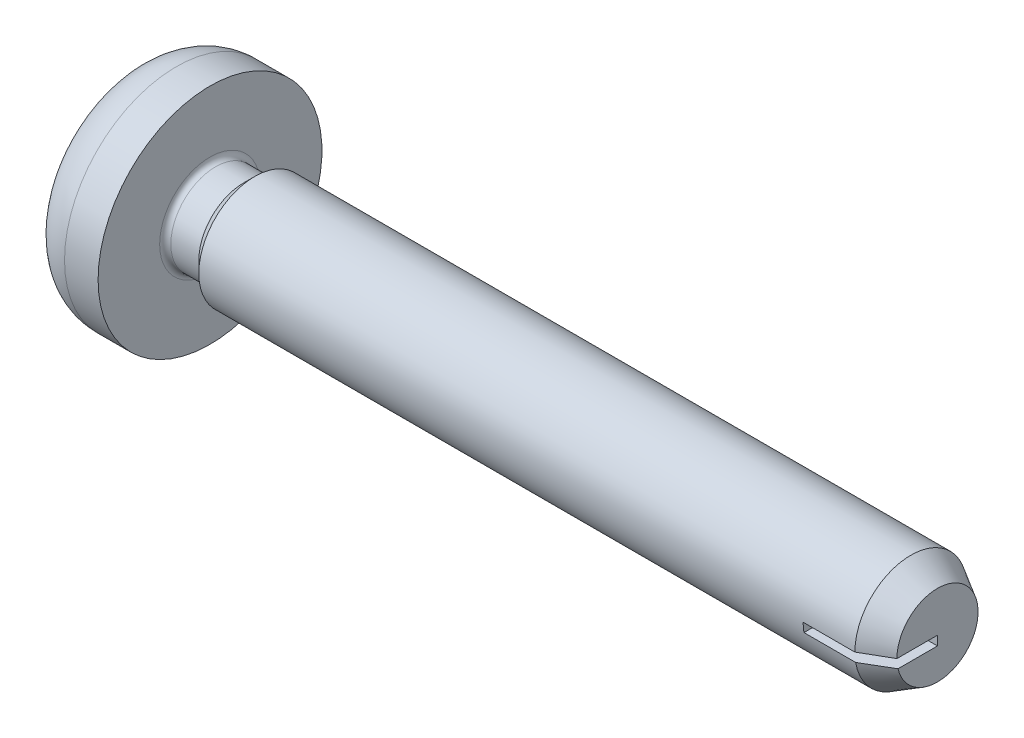
ISO-10303-21;
HEADER;
FILE_DESCRIPTION(('STEP AP214'),'2;1');
FILE_NAME('part.step','',(''),(''),'','','');
FILE_SCHEMA(('AUTOMOTIVE_DESIGN { 1 0 10303 214 1 1 1 1 }'));
ENDSEC;
DATA;
#1=APPLICATION_CONTEXT('core data for automotive mechanical design processes');
#2=APPLICATION_PROTOCOL_DEFINITION('international standard','automotive_design',2000,#1);
#3=PRODUCT_CONTEXT('',#1,'mechanical');
#4=PRODUCT('Part','Part','',(#3));
#5=PRODUCT_RELATED_PRODUCT_CATEGORY('part','',(#4));
#6=PRODUCT_DEFINITION_FORMATION('','',#4);
#7=PRODUCT_DEFINITION_CONTEXT('part definition',#1,'design');
#8=PRODUCT_DEFINITION('design','',#6,#7);
#9=PRODUCT_DEFINITION_SHAPE('','',#8);
#10=(LENGTH_UNIT() NAMED_UNIT(*) SI_UNIT(.MILLI.,.METRE.));
#11=(NAMED_UNIT(*) PLANE_ANGLE_UNIT() SI_UNIT($,.RADIAN.));
#12=(NAMED_UNIT(*) SI_UNIT($,.STERADIAN.) SOLID_ANGLE_UNIT());
#13=UNCERTAINTY_MEASURE_WITH_UNIT(LENGTH_MEASURE(1.E-05),#10,'distance_accuracy_value','');
#14=(GEOMETRIC_REPRESENTATION_CONTEXT(3) GLOBAL_UNCERTAINTY_ASSIGNED_CONTEXT((#13)) GLOBAL_UNIT_ASSIGNED_CONTEXT((#10,
#11,#12)) REPRESENTATION_CONTEXT('',''));
#15=CARTESIAN_POINT('',(0.,0.,0.));
#16=DIRECTION('',(0.,0.,1.));
#17=DIRECTION('',(1.,0.,0.));
#18=AXIS2_PLACEMENT_3D('',#15,#16,#17);
#19=CARTESIAN_POINT('',(0.,0.,0.));
#20=DIRECTION('',(-1.,0.,0.));
#21=DIRECTION('',(0.,0.,1.));
#22=AXIS2_PLACEMENT_3D('',#19,#20,#21);
#23=CYLINDRICAL_SURFACE('',#22,1.);
#24=CARTESIAN_POINT('',(2.2,0.,0.));
#25=DIRECTION('',(-1.,0.,0.));
#26=DIRECTION('',(0.,0.,1.));
#27=AXIS2_PLACEMENT_3D('',#24,#25,#26);
#28=CIRCLE('',#27,1.);
#29=CARTESIAN_POINT('',(2.2,0.,0.999999999999998));
#30=VERTEX_POINT('',#29);
#31=EDGE_CURVE('E188',#30,#30,#28,.T.);
#32=ORIENTED_EDGE('',*,*,#31,.F.);
#33=EDGE_LOOP('',(#32));
#34=FACE_BOUND('',#33,.T.);
#35=DIRECTION('',(-1.,0.,0.));
#36=VECTOR('',#35,1.);
#37=CARTESIAN_POINT('',(0.,0.,1.));
#38=LINE('',#37,#36);
#39=CARTESIAN_POINT('',(13.9236860279185,0.,1.));
#40=VERTEX_POINT('',#39);
#41=CARTESIAN_POINT('',(13.,0.,0.999999999999999));
#42=VERTEX_POINT('',#41);
#43=EDGE_CURVE('E387',#40,#42,#38,.T.);
#44=ORIENTED_EDGE('',*,*,#43,.F.);
#45=CARTESIAN_POINT('',(13.9236860279185,0.,0.));
#46=DIRECTION('',(-1.,0.,0.));
#47=DIRECTION('',(0.,0.,1.));
#48=AXIS2_PLACEMENT_3D('',#45,#46,#47);
#49=CIRCLE('',#48,1.);
#50=CARTESIAN_POINT('',(13.9236860279185,-0.166666666666662,0.986013297183272));
#51=VERTEX_POINT('',#50);
#52=EDGE_CURVE('E383',#40,#51,#49,.T.);
#53=ORIENTED_EDGE('',*,*,#52,.T.);
#54=DIRECTION('',(-1.,0.,0.));
#55=VECTOR('',#54,1.);
#56=CARTESIAN_POINT('',(0.,-0.166666666666669,0.986013297183258));
#57=LINE('',#56,#55);
#58=CARTESIAN_POINT('',(13.,-0.166666666666662,0.98601329718327));
#59=VERTEX_POINT('',#58);
#60=EDGE_CURVE('E393',#59,#51,#57,.F.);
#61=ORIENTED_EDGE('',*,*,#60,.F.);
#62=CARTESIAN_POINT('',(13.,0.,0.));
#63=DIRECTION('',(1.,0.,0.));
#64=DIRECTION('',(0.,0.,-1.));
#65=AXIS2_PLACEMENT_3D('',#62,#63,#64);
#66=CIRCLE('',#65,1.);
#67=EDGE_CURVE('E11',#42,#59,#66,.T.);
#68=ORIENTED_EDGE('',*,*,#67,.F.);
#69=EDGE_LOOP('',(#44,#53,#61,#68));
#70=FACE_BOUND('',#69,.T.);
#71=ADVANCED_FACE('F17',(#34,#70),#23,.T.);
#72=CARTESIAN_POINT('',(13.9236860279185,0.,0.));
#73=DIRECTION('',(-1.,0.,0.));
#74=DIRECTION('',(0.,0.,1.));
#75=AXIS2_PLACEMENT_3D('',#72,#73,#74);
#76=CONICAL_SURFACE('',#75,1.,0.523598775598297);
#77=ORIENTED_EDGE('',*,*,#52,.F.);
#78=DIRECTION('',(-0.866025403784442,0.,0.5));
#79=VECTOR('',#78,1.);
#80=CARTESIAN_POINT('',(15.6557368354874,0.,0.));
#81=LINE('',#80,#79);
#82=CARTESIAN_POINT('',(14.4,0.,0.725000000000003));
#83=VERTEX_POINT('',#82);
#84=EDGE_CURVE('E390',#40,#83,#81,.F.);
#85=ORIENTED_EDGE('',*,*,#84,.T.);
#86=CARTESIAN_POINT('',(14.4,0.,0.));
#87=DIRECTION('',(-1.,0.,0.));
#88=DIRECTION('',(0.,0.,1.));
#89=AXIS2_PLACEMENT_3D('',#86,#87,#88);
#90=CIRCLE('',#89,0.725);
#91=CARTESIAN_POINT('',(14.4,-0.166666666666662,0.705582895358312));
#92=VERTEX_POINT('',#91);
#93=EDGE_CURVE('E182',#83,#92,#90,.T.);
#94=ORIENTED_EDGE('',*,*,#93,.T.);
#95=CARTESIAN_POINT('',(15.2015838133216,-0.166666666666662,0.202420053526553));
#96=CARTESIAN_POINT('',(15.189887832029,-0.166666666666657,0.211160466548655));
#97=CARTESIAN_POINT('',(15.1780902535194,-0.166666666666655,0.219762178615637));
#98=CARTESIAN_POINT('',(15.1543389401954,-0.166666666666653,0.236744395333103));
#99=CARTESIAN_POINT('',(15.142385225452,-0.166666666666654,0.245124928005312));
#100=CARTESIAN_POINT('',(15.1063635434149,-0.166666666666655,0.270017020748613));
#101=CARTESIAN_POINT('',(15.0821275398099,-0.166666666666655,0.286284562967412));
#102=CARTESIAN_POINT('',(15.0334017925879,-0.166666666666653,0.318405310598186));
#103=CARTESIAN_POINT('',(15.008912180223,-0.166666666666652,0.334258716708558));
#104=CARTESIAN_POINT('',(14.9597551974988,-0.166666666666656,0.365692570195774));
#105=CARTESIAN_POINT('',(14.935087809159,-0.166666666666661,0.381272989399874));
#106=CARTESIAN_POINT('',(14.8639391094645,-0.166666666666665,0.425830715171781));
#107=CARTESIAN_POINT('',(14.8173079174778,-0.166666666666657,0.454568202998024));
#108=CARTESIAN_POINT('',(14.7238136343753,-0.166666666666651,0.511663876308527));
#109=CARTESIAN_POINT('',(14.6769505381078,-0.166666666666653,0.540022053314035));
#110=CARTESIAN_POINT('',(14.5361096703688,-0.166666666666657,0.624768530387812));
#111=CARTESIAN_POINT('',(14.4419200563487,-0.166666666666656,0.680804321809174));
#112=CARTESIAN_POINT('',(14.2031146481556,-0.166666666666655,0.822157213235219));
#113=CARTESIAN_POINT('',(14.0583320552326,-0.166666666666655,0.90719127212943));
#114=CARTESIAN_POINT('',(13.8410388744482,-0.166666666666654,1.03439645779868));
#115=CARTESIAN_POINT('',(13.7686188454335,-0.166666666666654,1.07672255711246));
#116=CARTESIAN_POINT('',(13.6237330605002,-0.166666666666656,1.16129606629587));
#117=CARTESIAN_POINT('',(13.5512673046818,-0.166666666666657,1.2035434763371));
#118=CARTESIAN_POINT('',(13.4787857816159,-0.166666666666662,1.24576382962675));
#119=B_SPLINE_CURVE_WITH_KNOTS('',3,(#95,#96,#97,#98,#99,#100,#101,#102,#103,#104,#105,#106,
#107,#108,#109,#110,#111,#112,#113,#114,#115,#116,#117,#118),.UNSPECIFIED.,.F.,.F.,(4,2,2,2,2,2,
2,2,2,2,2,4),(0.,0.0437997583052368,0.0875939406187678,0.175154441441496,0.262671690481119,
0.350197918883524,0.514519420031467,0.678844588147899,1.00763489196675,1.51135489439911,
1.76300032919029,2.01464521454734),.UNSPECIFIED.);
#120=EDGE_CURVE('E396',#92,#51,#119,.T.);
#121=ORIENTED_EDGE('',*,*,#120,.T.);
#122=EDGE_LOOP('',(#77,#85,#94,#121));
#123=FACE_BOUND('',#122,.T.);
#124=ADVANCED_FACE('F407',(#123),#76,.T.);
#125=CARTESIAN_POINT('',(14.4,1.,0.));
#126=DIRECTION('',(-1.,0.,0.));
#127=DIRECTION('',(0.,0.,1.));
#128=AXIS2_PLACEMENT_3D('',#125,#126,#127);
#129=PLANE('',#128);
#130=DIRECTION('',(0.,0.,1.));
#131=VECTOR('',#130,1.);
#132=CARTESIAN_POINT('',(14.4,0.,0.));
#133=LINE('',#132,#131);
#134=CARTESIAN_POINT('',(14.4,0.,0.));
#135=VERTEX_POINT('',#134);
#136=EDGE_CURVE('E26',#135,#83,#133,.T.);
#137=ORIENTED_EDGE('',*,*,#136,.F.);
#138=DIRECTION('',(0.,1.,0.));
#139=VECTOR('',#138,1.);
#140=CARTESIAN_POINT('',(14.4,0.,0.));
#141=LINE('',#140,#139);
#142=CARTESIAN_POINT('',(14.4,-0.166666666666662,0.));
#143=VERTEX_POINT('',#142);
#144=EDGE_CURVE('E171',#143,#135,#141,.T.);
#145=ORIENTED_EDGE('',*,*,#144,.F.);
#146=DIRECTION('',(0.,0.,-1.));
#147=VECTOR('',#146,1.);
#148=CARTESIAN_POINT('',(14.4,-0.166666666666662,0.));
#149=LINE('',#148,#147);
#150=EDGE_CURVE('E184',#92,#143,#149,.T.);
#151=ORIENTED_EDGE('',*,*,#150,.F.);
#152=ORIENTED_EDGE('',*,*,#93,.F.);
#153=EDGE_LOOP('',(#137,#145,#151,#152));
#154=FACE_BOUND('',#153,.T.);
#155=ADVANCED_FACE('F180',(#154),#129,.F.);
#156=CARTESIAN_POINT('',(0.,0.,0.));
#157=DIRECTION('',(1.,0.,0.));
#158=DIRECTION('',(0.,0.,-1.));
#159=AXIS2_PLACEMENT_3D('',#156,#157,#158);
#160=PLANE('',#159);
#161=CARTESIAN_POINT('',(0.,0.,0.));
#162=DIRECTION('',(-1.,0.,0.));
#163=DIRECTION('',(0.,0.,1.));
#164=AXIS2_PLACEMENT_3D('',#161,#162,#163);
#165=CIRCLE('',#164,1.2);
#166=CARTESIAN_POINT('',(0.,0.,1.2));
#167=VERTEX_POINT('',#166);
#168=EDGE_CURVE('E221',#167,#167,#165,.T.);
#169=ORIENTED_EDGE('',*,*,#168,.T.);
#170=EDGE_LOOP('',(#169));
#171=FACE_BOUND('',#170,.T.);
#172=DIRECTION('',(0.,0.,-1.));
#173=VECTOR('',#172,1.);
#174=CARTESIAN_POINT('',(0.,-0.265000000000001,0.265000000000001));
#175=LINE('',#174,#173);
#176=CARTESIAN_POINT('',(0.,-0.264999999999994,1.07));
#177=VERTEX_POINT('',#176);
#178=CARTESIAN_POINT('',(0.,-0.264999999999994,0.479000000000007));
#179=VERTEX_POINT('',#178);
#180=EDGE_CURVE('E288',#177,#179,#175,.T.);
#181=ORIENTED_EDGE('',*,*,#180,.T.);
#182=DIRECTION('',(0.,0.707106781186548,0.707106781186547));
#183=VECTOR('',#182,1.);
#184=CARTESIAN_POINT('',(0.,-0.479,0.265000000000001));
#185=LINE('',#184,#183);
#186=CARTESIAN_POINT('',(0.,-0.479,0.265000000000001));
#187=VERTEX_POINT('',#186);
#188=EDGE_CURVE('E375',#187,#179,#185,.T.);
#189=ORIENTED_EDGE('',*,*,#188,.F.);
#190=DIRECTION('',(0.,-1.,0.));
#191=VECTOR('',#190,1.);
#192=CARTESIAN_POINT('',(0.,-0.265000000000001,0.265000000000001));
#193=LINE('',#192,#191);
#194=CARTESIAN_POINT('',(0.,-1.07,0.265000000000001));
#195=VERTEX_POINT('',#194);
#196=EDGE_CURVE('E285',#187,#195,#193,.T.);
#197=ORIENTED_EDGE('',*,*,#196,.T.);
#198=DIRECTION('',(0.,0.,-1.));
#199=VECTOR('',#198,1.);
#200=CARTESIAN_POINT('',(0.,-1.07,-0.265000000000001));
#201=LINE('',#200,#199);
#202=CARTESIAN_POINT('',(0.,-1.07,-0.265000000000001));
#203=VERTEX_POINT('',#202);
#204=EDGE_CURVE('E281',#195,#203,#201,.T.);
#205=ORIENTED_EDGE('',*,*,#204,.T.);
#206=DIRECTION('',(0.,1.,0.));
#207=VECTOR('',#206,1.);
#208=CARTESIAN_POINT('',(0.,-0.265000000000001,-0.264999999999987));
#209=LINE('',#208,#207);
#210=CARTESIAN_POINT('',(0.,-0.479,-0.265000000000001));
#211=VERTEX_POINT('',#210);
#212=EDGE_CURVE('E277',#203,#211,#209,.T.);
#213=ORIENTED_EDGE('',*,*,#212,.T.);
#214=DIRECTION('',(0.,-0.707106781186548,0.707106781186547));
#215=VECTOR('',#214,1.);
#216=CARTESIAN_POINT('',(0.,-0.479,-0.265000000000001));
#217=LINE('',#216,#215);
#218=CARTESIAN_POINT('',(0.,-0.264999999999994,-0.478999999999993));
#219=VERTEX_POINT('',#218);
#220=EDGE_CURVE('E361',#219,#211,#217,.T.);
#221=ORIENTED_EDGE('',*,*,#220,.F.);
#222=DIRECTION('',(0.,0.,-1.));
#223=VECTOR('',#222,1.);
#224=CARTESIAN_POINT('',(0.,-0.264999999999994,-1.06999999999999));
#225=LINE('',#224,#223);
#226=CARTESIAN_POINT('',(0.,-0.264999999999994,-1.06999999999999));
#227=VERTEX_POINT('',#226);
#228=EDGE_CURVE('E274',#219,#227,#225,.T.);
#229=ORIENTED_EDGE('',*,*,#228,.T.);
#230=DIRECTION('',(0.,1.,0.));
#231=VECTOR('',#230,1.);
#232=CARTESIAN_POINT('',(0.,0.265000000000001,-1.06999999999999));
#233=LINE('',#232,#231);
#234=CARTESIAN_POINT('',(0.,0.265000000000001,-1.06999999999999));
#235=VERTEX_POINT('',#234);
#236=EDGE_CURVE('E270',#227,#235,#233,.T.);
#237=ORIENTED_EDGE('',*,*,#236,.T.);
#238=DIRECTION('',(0.,0.,1.));
#239=VECTOR('',#238,1.);
#240=CARTESIAN_POINT('',(0.,0.265000000000001,-1.06999999999999));
#241=LINE('',#240,#239);
#242=CARTESIAN_POINT('',(0.,0.265000000000001,-0.478999999999993));
#243=VERTEX_POINT('',#242);
#244=EDGE_CURVE('E266',#235,#243,#241,.T.);
#245=ORIENTED_EDGE('',*,*,#244,.T.);
#246=DIRECTION('',(0.,-0.707106781186549,-0.707106781186547));
#247=VECTOR('',#246,1.);
#248=CARTESIAN_POINT('',(0.,0.479,-0.265000000000001));
#249=LINE('',#248,#247);
#250=CARTESIAN_POINT('',(0.,0.479,-0.265000000000001));
#251=VERTEX_POINT('',#250);
#252=EDGE_CURVE('E350',#251,#243,#249,.T.);
#253=ORIENTED_EDGE('',*,*,#252,.F.);
#254=DIRECTION('',(0.,1.,0.));
#255=VECTOR('',#254,1.);
#256=CARTESIAN_POINT('',(0.,1.07,-0.264999999999987));
#257=LINE('',#256,#255);
#258=CARTESIAN_POINT('',(0.,1.07,-0.264999999999987));
#259=VERTEX_POINT('',#258);
#260=EDGE_CURVE('E307',#251,#259,#257,.T.);
#261=ORIENTED_EDGE('',*,*,#260,.T.);
#262=DIRECTION('',(0.,0.,1.));
#263=VECTOR('',#262,1.);
#264=CARTESIAN_POINT('',(0.,1.07,-0.264999999999987));
#265=LINE('',#264,#263);
#266=CARTESIAN_POINT('',(0.,1.07,0.265000000000015));
#267=VERTEX_POINT('',#266);
#268=EDGE_CURVE('E303',#259,#267,#265,.T.);
#269=ORIENTED_EDGE('',*,*,#268,.T.);
#270=DIRECTION('',(0.,-1.,0.));
#271=VECTOR('',#270,1.);
#272=CARTESIAN_POINT('',(0.,1.07,0.265000000000015));
#273=LINE('',#272,#271);
#274=CARTESIAN_POINT('',(0.,0.479,0.265000000000001));
#275=VERTEX_POINT('',#274);
#276=EDGE_CURVE('E299',#267,#275,#273,.T.);
#277=ORIENTED_EDGE('',*,*,#276,.T.);
#278=DIRECTION('',(0.,0.707106781186549,-0.707106781186547));
#279=VECTOR('',#278,1.);
#280=CARTESIAN_POINT('',(0.,0.479,0.265000000000001));
#281=LINE('',#280,#279);
#282=CARTESIAN_POINT('',(0.,0.265000000000001,0.479000000000007));
#283=VERTEX_POINT('',#282);
#284=EDGE_CURVE('E335',#283,#275,#281,.T.);
#285=ORIENTED_EDGE('',*,*,#284,.F.);
#286=DIRECTION('',(0.,0.,1.));
#287=VECTOR('',#286,1.);
#288=CARTESIAN_POINT('',(0.,0.265000000000001,0.265000000000001));
#289=LINE('',#288,#287);
#290=CARTESIAN_POINT('',(0.,0.265000000000008,1.07));
#291=VERTEX_POINT('',#290);
#292=EDGE_CURVE('E296',#283,#291,#289,.T.);
#293=ORIENTED_EDGE('',*,*,#292,.T.);
#294=DIRECTION('',(0.,-1.,0.));
#295=VECTOR('',#294,1.);
#296=CARTESIAN_POINT('',(0.,0.265000000000008,1.07));
#297=LINE('',#296,#295);
#298=EDGE_CURVE('E292',#291,#177,#297,.T.);
#299=ORIENTED_EDGE('',*,*,#298,.T.);
#300=EDGE_LOOP('',(#181,#189,#197,#205,#213,#221,#229,#237,#245,#253,#261,#269,#277,#285,#293,#299));
#301=FACE_BOUND('',#300,.T.);
#302=ADVANCED_FACE('F440',(#171,#301),#160,.F.);
#303=CARTESIAN_POINT('',(2.2,0.,0.));
#304=DIRECTION('',(1.,0.,0.));
#305=DIRECTION('',(0.,0.,-1.));
#306=AXIS2_PLACEMENT_3D('',#303,#304,#305);
#307=CONICAL_SURFACE('',#306,1.,0.785398163397449);
#308=CARTESIAN_POINT('',(2.,0.,0.));
#309=DIRECTION('',(-1.,0.,0.));
#310=DIRECTION('',(0.,0.,1.));
#311=AXIS2_PLACEMENT_3D('',#308,#309,#310);
#312=CIRCLE('',#311,0.8);
#313=CARTESIAN_POINT('',(2.,0.,0.799999999999998));
#314=VERTEX_POINT('',#313);
#315=EDGE_CURVE('E243',#314,#314,#312,.T.);
#316=ORIENTED_EDGE('',*,*,#315,.F.);
#317=EDGE_LOOP('',(#316));
#318=FACE_BOUND('',#317,.T.);
#319=ORIENTED_EDGE('',*,*,#31,.T.);
#320=EDGE_LOOP('',(#319));
#321=FACE_BOUND('',#320,.T.);
#322=ADVANCED_FACE('F436',(#318,#321),#307,.T.);
#323=CARTESIAN_POINT('',(0.,0.,0.));
#324=DIRECTION('',(-1.,0.,0.));
#325=DIRECTION('',(0.,0.,1.));
#326=AXIS2_PLACEMENT_3D('',#323,#324,#325);
#327=CYLINDRICAL_SURFACE('',#326,0.8);
#328=CARTESIAN_POINT('',(1.5,0.,0.));
#329=DIRECTION('',(-1.,0.,0.));
#330=DIRECTION('',(0.,0.,1.));
#331=AXIS2_PLACEMENT_3D('',#328,#329,#330);
#332=CIRCLE('',#331,0.8);
#333=CARTESIAN_POINT('',(1.5,0.,0.8));
#334=VERTEX_POINT('',#333);
#335=EDGE_CURVE('E247',#334,#334,#332,.T.);
#336=ORIENTED_EDGE('',*,*,#335,.F.);
#337=EDGE_LOOP('',(#336));
#338=FACE_BOUND('',#337,.T.);
#339=ORIENTED_EDGE('',*,*,#315,.T.);
#340=EDGE_LOOP('',(#339));
#341=FACE_BOUND('',#340,.T.);
#342=ADVANCED_FACE('F563',(#338,#341),#327,.T.);
#343=CARTESIAN_POINT('',(1.5,0.,0.));
#344=DIRECTION('',(-1.,0.,0.));
#345=DIRECTION('',(0.,0.,1.));
#346=AXIS2_PLACEMENT_3D('',#343,#344,#345);
#347=TOROIDAL_SURFACE('',#346,0.9,0.1);
#348=CARTESIAN_POINT('',(1.4,0.,0.));
#349=DIRECTION('',(-1.,0.,0.));
#350=DIRECTION('',(0.,0.,1.));
#351=AXIS2_PLACEMENT_3D('',#348,#349,#350);
#352=CIRCLE('',#351,0.9);
#353=CARTESIAN_POINT('',(1.4,0.,0.9));
#354=VERTEX_POINT('',#353);
#355=EDGE_CURVE('E251',#354,#354,#352,.T.);
#356=ORIENTED_EDGE('',*,*,#355,.F.);
#357=EDGE_LOOP('',(#356));
#358=FACE_BOUND('',#357,.T.);
#359=ORIENTED_EDGE('',*,*,#335,.T.);
#360=EDGE_LOOP('',(#359));
#361=FACE_BOUND('',#360,.T.);
#362=ADVANCED_FACE('F560',(#358,#361),#347,.F.);
#363=CARTESIAN_POINT('',(1.4,1.99999999999999,0.));
#364=DIRECTION('',(-1.,0.,0.));
#365=DIRECTION('',(0.,0.,1.));
#366=AXIS2_PLACEMENT_3D('',#363,#364,#365);
#367=PLANE('',#366);
#368=CARTESIAN_POINT('',(1.4,0.,0.));
#369=DIRECTION('',(-1.,0.,0.));
#370=DIRECTION('',(0.,0.,1.));
#371=AXIS2_PLACEMENT_3D('',#368,#369,#370);
#372=CIRCLE('',#371,2.);
#373=CARTESIAN_POINT('',(1.4,0.,2.));
#374=VERTEX_POINT('',#373);
#375=EDGE_CURVE('E255',#374,#374,#372,.T.);
#376=ORIENTED_EDGE('',*,*,#375,.F.);
#377=EDGE_LOOP('',(#376));
#378=FACE_BOUND('',#377,.T.);
#379=ORIENTED_EDGE('',*,*,#355,.T.);
#380=EDGE_LOOP('',(#379));
#381=FACE_BOUND('',#380,.T.);
#382=ADVANCED_FACE('F556',(#378,#381),#367,.F.);
#383=CARTESIAN_POINT('',(0.,0.,0.));
#384=DIRECTION('',(-1.,0.,0.));
#385=DIRECTION('',(0.,0.,1.));
#386=AXIS2_PLACEMENT_3D('',#383,#384,#385);
#387=CYLINDRICAL_SURFACE('',#386,2.);
#388=CARTESIAN_POINT('',(0.799999999999999,0.,0.));
#389=DIRECTION('',(-1.,0.,0.));
#390=DIRECTION('',(0.,0.,1.));
#391=AXIS2_PLACEMENT_3D('',#388,#389,#390);
#392=CIRCLE('',#391,2.);
#393=CARTESIAN_POINT('',(0.799999999999999,0.,2.));
#394=VERTEX_POINT('',#393);
#395=EDGE_CURVE('E259',#394,#394,#392,.T.);
#396=ORIENTED_EDGE('',*,*,#395,.F.);
#397=EDGE_LOOP('',(#396));
#398=FACE_BOUND('',#397,.T.);
#399=ORIENTED_EDGE('',*,*,#375,.T.);
#400=EDGE_LOOP('',(#399));
#401=FACE_BOUND('',#400,.T.);
#402=ADVANCED_FACE('F552',(#398,#401),#387,.T.);
#403=CARTESIAN_POINT('',(0.799999999999999,0.,0.));
#404=DIRECTION('',(-1.,0.,0.));
#405=DIRECTION('',(0.,0.,1.));
#406=AXIS2_PLACEMENT_3D('',#403,#404,#405);
#407=TOROIDAL_SURFACE('',#406,1.2,0.8);
#408=ORIENTED_EDGE('',*,*,#168,.F.);
#409=EDGE_LOOP('',(#408));
#410=FACE_BOUND('',#409,.T.);
#411=ORIENTED_EDGE('',*,*,#395,.T.);
#412=EDGE_LOOP('',(#411));
#413=FACE_BOUND('',#412,.T.);
#414=ADVANCED_FACE('F546',(#410,#413),#407,.T.);
#415=CARTESIAN_POINT('',(0.95,1.06999999999999,-0.265000000000001));
#416=DIRECTION('',(0.,0.,1.));
#417=DIRECTION('',(1.,0.,0.));
#418=AXIS2_PLACEMENT_3D('',#415,#416,#417);
#419=PLANE('',#418);
#420=DIRECTION('',(-1.,0.,0.));
#421=VECTOR('',#420,1.);
#422=CARTESIAN_POINT('',(1.25264170234784,0.478999999999999,-0.265000000000001));
#423=LINE('',#422,#421);
#424=CARTESIAN_POINT('',(0.95,0.478999999999999,-0.265000000000001));
#425=VERTEX_POINT('',#424);
#426=EDGE_CURVE('E347',#425,#251,#423,.T.);
#427=ORIENTED_EDGE('',*,*,#426,.F.);
#428=DIRECTION('',(0.,1.,0.));
#429=VECTOR('',#428,1.);
#430=CARTESIAN_POINT('',(0.95,1.06999999999999,-0.265000000000001));
#431=LINE('',#430,#429);
#432=CARTESIAN_POINT('',(0.95,0.724228277447106,-0.265000000000001));
#433=VERTEX_POINT('',#432);
#434=EDGE_CURVE('E226',#425,#433,#431,.T.);
#435=ORIENTED_EDGE('',*,*,#434,.T.);
#436=DIRECTION('',(-0.939692620785908,0.342020143325669,0.));
#437=VECTOR('',#436,1.);
#438=CARTESIAN_POINT('',(0.,1.07,-0.264999999999987));
#439=LINE('',#438,#437);
#440=EDGE_CURVE('E217',#433,#259,#439,.T.);
#441=ORIENTED_EDGE('',*,*,#440,.T.);
#442=ORIENTED_EDGE('',*,*,#260,.F.);
#443=EDGE_LOOP('',(#427,#435,#441,#442));
#444=FACE_BOUND('',#443,.T.);
#445=ADVANCED_FACE('F513',(#444),#419,.T.);
#446=CARTESIAN_POINT('',(0.,1.07,-0.264999999999987));
#447=DIRECTION('',(-0.342020143325669,-0.939692620785908,0.));
#448=DIRECTION('',(0.939692620785908,-0.342020143325669,0.));
#449=AXIS2_PLACEMENT_3D('',#446,#447,#448);
#450=PLANE('',#449);
#451=ORIENTED_EDGE('',*,*,#268,.F.);
#452=ORIENTED_EDGE('',*,*,#440,.F.);
#453=DIRECTION('',(0.,0.,1.));
#454=VECTOR('',#453,1.);
#455=CARTESIAN_POINT('',(0.95,0.724228277447106,-0.265000000000001));
#456=LINE('',#455,#454);
#457=CARTESIAN_POINT('',(0.95,0.724228277447106,0.265000000000001));
#458=VERTEX_POINT('',#457);
#459=EDGE_CURVE('E222',#433,#458,#456,.T.);
#460=ORIENTED_EDGE('',*,*,#459,.T.);
#461=DIRECTION('',(-0.939692620785908,0.342020143325669,0.));
#462=VECTOR('',#461,1.);
#463=CARTESIAN_POINT('',(0.838871110481513,0.764675885398891,0.265000000000001));
#464=LINE('',#463,#462);
#465=EDGE_CURVE('E209',#458,#267,#464,.T.);
#466=ORIENTED_EDGE('',*,*,#465,.T.);
#467=EDGE_LOOP('',(#451,#452,#460,#466));
#468=FACE_BOUND('',#467,.T.);
#469=ADVANCED_FACE('F19',(#468),#450,.T.);
#470=CARTESIAN_POINT('',(0.949999999999999,1.07,0.265000000000001));
#471=DIRECTION('',(0.,0.,-1.));
#472=DIRECTION('',(0.,1.,0.));
#473=AXIS2_PLACEMENT_3D('',#470,#471,#472);
#474=PLANE('',#473);
#475=DIRECTION('',(-1.,0.,0.));
#476=VECTOR('',#475,1.);
#477=CARTESIAN_POINT('',(1.25264170234784,0.478999999999999,0.265000000000001));
#478=LINE('',#477,#476);
#479=CARTESIAN_POINT('',(0.95,0.478999999999999,0.265000000000001));
#480=VERTEX_POINT('',#479);
#481=EDGE_CURVE('E334',#480,#275,#478,.T.);
#482=ORIENTED_EDGE('',*,*,#481,.T.);
#483=ORIENTED_EDGE('',*,*,#276,.F.);
#484=ORIENTED_EDGE('',*,*,#465,.F.);
#485=DIRECTION('',(0.,-1.,0.));
#486=VECTOR('',#485,1.);
#487=CARTESIAN_POINT('',(0.949999999999999,1.07,0.265000000000001));
#488=LINE('',#487,#486);
#489=EDGE_CURVE('E225',#458,#480,#488,.T.);
#490=ORIENTED_EDGE('',*,*,#489,.T.);
#491=EDGE_LOOP('',(#482,#483,#484,#490));
#492=FACE_BOUND('',#491,.T.);
#493=ADVANCED_FACE('F463',(#492),#474,.T.);
#494=CARTESIAN_POINT('',(0.95,0.265,0.265000000000001));
#495=DIRECTION('',(0.,-1.,0.));
#496=DIRECTION('',(0.,0.,-1.));
#497=AXIS2_PLACEMENT_3D('',#494,#495,#496);
#498=PLANE('',#497);
#499=DIRECTION('',(-1.,0.,0.));
#500=VECTOR('',#499,1.);
#501=CARTESIAN_POINT('',(1.25264170234784,0.265,0.479000000000007));
#502=LINE('',#501,#500);
#503=CARTESIAN_POINT('',(0.95,0.265,0.479000000000007));
#504=VERTEX_POINT('',#503);
#505=EDGE_CURVE('E331',#504,#283,#502,.T.);
#506=ORIENTED_EDGE('',*,*,#505,.F.);
#507=DIRECTION('',(0.,0.,1.));
#508=VECTOR('',#507,1.);
#509=CARTESIAN_POINT('',(0.95,0.265,0.265000000000001));
#510=LINE('',#509,#508);
#511=CARTESIAN_POINT('',(0.95,0.265000000000007,0.724228277447114));
#512=VERTEX_POINT('',#511);
#513=EDGE_CURVE('E214',#504,#512,#510,.T.);
#514=ORIENTED_EDGE('',*,*,#513,.T.);
#515=DIRECTION('',(-0.939692620785908,0.,0.342020143325669));
#516=VECTOR('',#515,1.);
#517=CARTESIAN_POINT('',(0.,0.265000000000008,1.07));
#518=LINE('',#517,#516);
#519=EDGE_CURVE('E205',#512,#291,#518,.T.);
#520=ORIENTED_EDGE('',*,*,#519,.T.);
#521=ORIENTED_EDGE('',*,*,#292,.F.);
#522=EDGE_LOOP('',(#506,#514,#520,#521));
#523=FACE_BOUND('',#522,.T.);
#524=ADVANCED_FACE('F455',(#523),#498,.T.);
#525=CARTESIAN_POINT('',(0.,0.265000000000008,1.07));
#526=DIRECTION('',(-0.342020143325669,0.,-0.939692620785908));
#527=DIRECTION('',(-0.939692620785908,0.,0.342020143325669));
#528=AXIS2_PLACEMENT_3D('',#525,#526,#527);
#529=PLANE('',#528);
#530=ORIENTED_EDGE('',*,*,#298,.F.);
#531=ORIENTED_EDGE('',*,*,#519,.F.);
#532=DIRECTION('',(0.,-1.,0.));
#533=VECTOR('',#532,1.);
#534=CARTESIAN_POINT('',(0.95,0.265000000000007,0.724228277447114));
#535=LINE('',#534,#533);
#536=CARTESIAN_POINT('',(0.95,-0.264999999999996,0.7242282774471));
#537=VERTEX_POINT('',#536);
#538=EDGE_CURVE('E210',#512,#537,#535,.T.);
#539=ORIENTED_EDGE('',*,*,#538,.T.);
#540=DIRECTION('',(-0.939692620785908,0.,0.342020143325669));
#541=VECTOR('',#540,1.);
#542=CARTESIAN_POINT('',(1.09759312338035,-0.265000000000003,0.670508773754283));
#543=LINE('',#542,#541);
#544=EDGE_CURVE('E195',#537,#177,#543,.T.);
#545=ORIENTED_EDGE('',*,*,#544,.T.);
#546=EDGE_LOOP('',(#530,#531,#539,#545));
#547=FACE_BOUND('',#546,.T.);
#548=ADVANCED_FACE('F452',(#547),#529,.T.);
#549=CARTESIAN_POINT('',(0.95,-0.265000000000003,0.265000000000001));
#550=DIRECTION('',(0.,1.,0.));
#551=DIRECTION('',(0.,0.,1.));
#552=AXIS2_PLACEMENT_3D('',#549,#550,#551);
#553=PLANE('',#552);
#554=DIRECTION('',(-1.,0.,0.));
#555=VECTOR('',#554,1.);
#556=CARTESIAN_POINT('',(1.25264170234784,-0.264999999999996,0.478999999999993));
#557=LINE('',#556,#555);
#558=CARTESIAN_POINT('',(0.95,-0.264999999999996,0.478999999999993));
#559=VERTEX_POINT('',#558);
#560=EDGE_CURVE('E371',#559,#179,#557,.T.);
#561=ORIENTED_EDGE('',*,*,#560,.T.);
#562=ORIENTED_EDGE('',*,*,#180,.F.);
#563=ORIENTED_EDGE('',*,*,#544,.F.);
#564=DIRECTION('',(0.,0.,-1.));
#565=VECTOR('',#564,1.);
#566=CARTESIAN_POINT('',(0.95,-0.265000000000003,0.265000000000001));
#567=LINE('',#566,#565);
#568=EDGE_CURVE('E213',#537,#559,#567,.T.);
#569=ORIENTED_EDGE('',*,*,#568,.T.);
#570=EDGE_LOOP('',(#561,#562,#563,#569));
#571=FACE_BOUND('',#570,.T.);
#572=ADVANCED_FACE('F454',(#571),#553,.T.);
#573=CARTESIAN_POINT('',(0.95,-0.265000000000003,0.265000000000001));
#574=DIRECTION('',(0.,0.,-1.));
#575=DIRECTION('',(0.,1.,0.));
#576=AXIS2_PLACEMENT_3D('',#573,#574,#575);
#577=PLANE('',#576);
#578=DIRECTION('',(-1.,0.,0.));
#579=VECTOR('',#578,1.);
#580=CARTESIAN_POINT('',(1.25264170234784,-0.479000000000002,0.265000000000001));
#581=LINE('',#580,#579);
#582=CARTESIAN_POINT('',(0.95,-0.479000000000002,0.265000000000001));
#583=VERTEX_POINT('',#582);
#584=EDGE_CURVE('E372',#583,#187,#581,.T.);
#585=ORIENTED_EDGE('',*,*,#584,.F.);
#586=DIRECTION('',(0.,-1.,0.));
#587=VECTOR('',#586,1.);
#588=CARTESIAN_POINT('',(0.95,-0.265000000000003,0.265000000000001));
#589=LINE('',#588,#587);
#590=CARTESIAN_POINT('',(0.95,-0.724228277447109,0.265000000000001));
#591=VERTEX_POINT('',#590);
#592=EDGE_CURVE('E201',#583,#591,#589,.T.);
#593=ORIENTED_EDGE('',*,*,#592,.T.);
#594=DIRECTION('',(-0.939692620785908,-0.342020143325669,0.));
#595=VECTOR('',#594,1.);
#596=CARTESIAN_POINT('',(0.,-1.07,0.265000000000001));
#597=LINE('',#596,#595);
#598=EDGE_CURVE('E191',#591,#195,#597,.T.);
#599=ORIENTED_EDGE('',*,*,#598,.T.);
#600=ORIENTED_EDGE('',*,*,#196,.F.);
#601=EDGE_LOOP('',(#585,#593,#599,#600));
#602=FACE_BOUND('',#601,.T.);
#603=ADVANCED_FACE('F450',(#602),#577,.T.);
#604=CARTESIAN_POINT('',(0.,-1.07,-0.265000000000001));
#605=DIRECTION('',(-0.342020143325669,0.939692620785908,0.));
#606=DIRECTION('',(-0.939692620785908,-0.342020143325669,0.));
#607=AXIS2_PLACEMENT_3D('',#604,#605,#606);
#608=PLANE('',#607);
#609=ORIENTED_EDGE('',*,*,#204,.F.);
#610=ORIENTED_EDGE('',*,*,#598,.F.);
#611=DIRECTION('',(0.,0.,-1.));
#612=VECTOR('',#611,1.);
#613=CARTESIAN_POINT('',(0.95,-0.724228277447109,-0.265000000000001));
#614=LINE('',#613,#612);
#615=CARTESIAN_POINT('',(0.95,-0.724228277447109,-0.265000000000001));
#616=VERTEX_POINT('',#615);
#617=EDGE_CURVE('E197',#591,#616,#614,.T.);
#618=ORIENTED_EDGE('',*,*,#617,.T.);
#619=DIRECTION('',(-0.939692620785908,-0.342020143325669,0.));
#620=VECTOR('',#619,1.);
#621=CARTESIAN_POINT('',(1.09759312338035,-0.670508773754285,-0.265000000000001));
#622=LINE('',#621,#620);
#623=EDGE_CURVE('E196',#616,#203,#622,.T.);
#624=ORIENTED_EDGE('',*,*,#623,.T.);
#625=EDGE_LOOP('',(#609,#610,#618,#624));
#626=FACE_BOUND('',#625,.T.);
#627=ADVANCED_FACE('F447',(#626),#608,.T.);
#628=CARTESIAN_POINT('',(0.95,-0.265000000000003,-0.265000000000001));
#629=DIRECTION('',(0.,0.,1.));
#630=DIRECTION('',(1.,0.,0.));
#631=AXIS2_PLACEMENT_3D('',#628,#629,#630);
#632=PLANE('',#631);
#633=DIRECTION('',(-1.,0.,0.));
#634=VECTOR('',#633,1.);
#635=CARTESIAN_POINT('',(1.25264170234784,-0.479000000000002,-0.264999999999987));
#636=LINE('',#635,#634);
#637=CARTESIAN_POINT('',(0.95,-0.479000000000002,-0.265000000000001));
#638=VERTEX_POINT('',#637);
#639=EDGE_CURVE('E360',#638,#211,#636,.T.);
#640=ORIENTED_EDGE('',*,*,#639,.T.);
#641=ORIENTED_EDGE('',*,*,#212,.F.);
#642=ORIENTED_EDGE('',*,*,#623,.F.);
#643=DIRECTION('',(0.,1.,0.));
#644=VECTOR('',#643,1.);
#645=CARTESIAN_POINT('',(0.95,-0.265000000000003,-0.265000000000001));
#646=LINE('',#645,#644);
#647=EDGE_CURVE('E200',#616,#638,#646,.T.);
#648=ORIENTED_EDGE('',*,*,#647,.T.);
#649=EDGE_LOOP('',(#640,#641,#642,#648));
#650=FACE_BOUND('',#649,.T.);
#651=ADVANCED_FACE('F449',(#650),#632,.T.);
#652=CARTESIAN_POINT('',(0.95,-0.265000000000003,-1.07));
#653=DIRECTION('',(0.,1.,0.));
#654=DIRECTION('',(0.,0.,1.));
#655=AXIS2_PLACEMENT_3D('',#652,#653,#654);
#656=PLANE('',#655);
#657=DIRECTION('',(-1.,0.,0.));
#658=VECTOR('',#657,1.);
#659=CARTESIAN_POINT('',(1.25264170234784,-0.264999999999996,-0.479000000000007));
#660=LINE('',#659,#658);
#661=CARTESIAN_POINT('',(0.95,-0.264999999999996,-0.479000000000007));
#662=VERTEX_POINT('',#661);
#663=EDGE_CURVE('E357',#662,#219,#660,.T.);
#664=ORIENTED_EDGE('',*,*,#663,.F.);
#665=DIRECTION('',(0.,0.,-1.));
#666=VECTOR('',#665,1.);
#667=CARTESIAN_POINT('',(0.95,-0.265000000000003,-1.07));
#668=LINE('',#667,#666);
#669=CARTESIAN_POINT('',(0.95,-0.265000000000003,-0.724228277447114));
#670=VERTEX_POINT('',#669);
#671=EDGE_CURVE('E237',#662,#670,#668,.T.);
#672=ORIENTED_EDGE('',*,*,#671,.T.);
#673=DIRECTION('',(-0.939692620785908,0.,-0.342020143325669));
#674=VECTOR('',#673,1.);
#675=CARTESIAN_POINT('',(0.,-0.264999999999994,-1.06999999999999));
#676=LINE('',#675,#674);
#677=EDGE_CURVE('E204',#670,#227,#676,.T.);
#678=ORIENTED_EDGE('',*,*,#677,.T.);
#679=ORIENTED_EDGE('',*,*,#228,.F.);
#680=EDGE_LOOP('',(#664,#672,#678,#679));
#681=FACE_BOUND('',#680,.T.);
#682=ADVANCED_FACE('F445',(#681),#656,.T.);
#683=CARTESIAN_POINT('',(0.,0.265000000000001,-1.06999999999999));
#684=DIRECTION('',(-0.342020143325669,0.,0.939692620785908));
#685=DIRECTION('',(0.939692620785908,0.,0.342020143325669));
#686=AXIS2_PLACEMENT_3D('',#683,#684,#685);
#687=PLANE('',#686);
#688=ORIENTED_EDGE('',*,*,#236,.F.);
#689=ORIENTED_EDGE('',*,*,#677,.F.);
#690=DIRECTION('',(0.,1.,0.));
#691=VECTOR('',#690,1.);
#692=CARTESIAN_POINT('',(0.95,0.265,-0.7242282774471));
#693=LINE('',#692,#691);
#694=CARTESIAN_POINT('',(0.95,0.265,-0.7242282774471));
#695=VERTEX_POINT('',#694);
#696=EDGE_CURVE('E233',#670,#695,#693,.T.);
#697=ORIENTED_EDGE('',*,*,#696,.T.);
#698=DIRECTION('',(-0.939692620785908,0.,-0.342020143325669));
#699=VECTOR('',#698,1.);
#700=CARTESIAN_POINT('',(0.838871110481513,0.265,-0.764675885398886));
#701=LINE('',#700,#699);
#702=EDGE_CURVE('E232',#695,#235,#701,.T.);
#703=ORIENTED_EDGE('',*,*,#702,.T.);
#704=EDGE_LOOP('',(#688,#689,#697,#703));
#705=FACE_BOUND('',#704,.T.);
#706=ADVANCED_FACE('F441',(#705),#687,.T.);
#707=CARTESIAN_POINT('',(0.95,0.265,-1.06999999999999));
#708=DIRECTION('',(0.,-1.,0.));
#709=DIRECTION('',(0.,0.,-1.));
#710=AXIS2_PLACEMENT_3D('',#707,#708,#709);
#711=PLANE('',#710);
#712=DIRECTION('',(-1.,0.,0.));
#713=VECTOR('',#712,1.);
#714=CARTESIAN_POINT('',(1.25264170234784,0.265,-0.478999999999993));
#715=LINE('',#714,#713);
#716=CARTESIAN_POINT('',(0.95,0.265,-0.478999999999993));
#717=VERTEX_POINT('',#716);
#718=EDGE_CURVE('E346',#717,#243,#715,.T.);
#719=ORIENTED_EDGE('',*,*,#718,.T.);
#720=ORIENTED_EDGE('',*,*,#244,.F.);
#721=ORIENTED_EDGE('',*,*,#702,.F.);
#722=DIRECTION('',(0.,0.,1.));
#723=VECTOR('',#722,1.);
#724=CARTESIAN_POINT('',(0.95,0.265,-1.06999999999999));
#725=LINE('',#724,#723);
#726=EDGE_CURVE('E236',#695,#717,#725,.T.);
#727=ORIENTED_EDGE('',*,*,#726,.T.);
#728=EDGE_LOOP('',(#719,#720,#721,#727));
#729=FACE_BOUND('',#728,.T.);
#730=ADVANCED_FACE('F444',(#729),#711,.T.);
#731=CARTESIAN_POINT('',(0.95,0.265,-0.264999999999987));
#732=DIRECTION('',(-1.,0.,0.));
#733=DIRECTION('',(0.,0.,1.));
#734=AXIS2_PLACEMENT_3D('',#731,#732,#733);
#735=PLANE('',#734);
#736=ORIENTED_EDGE('',*,*,#592,.F.);
#737=DIRECTION('',(0.,-0.707106781186548,-0.707106781186547));
#738=VECTOR('',#737,1.);
#739=CARTESIAN_POINT('',(0.95,-0.479000000000002,0.265000000000001));
#740=LINE('',#739,#738);
#741=EDGE_CURVE('E41',#559,#583,#740,.T.);
#742=ORIENTED_EDGE('',*,*,#741,.F.);
#743=ORIENTED_EDGE('',*,*,#568,.F.);
#744=ORIENTED_EDGE('',*,*,#538,.F.);
#745=ORIENTED_EDGE('',*,*,#513,.F.);
#746=DIRECTION('',(0.,-0.707106781186549,0.707106781186547));
#747=VECTOR('',#746,1.);
#748=CARTESIAN_POINT('',(0.95,0.478999999999999,0.265000000000001));
#749=LINE('',#748,#747);
#750=EDGE_CURVE('E310',#480,#504,#749,.T.);
#751=ORIENTED_EDGE('',*,*,#750,.F.);
#752=ORIENTED_EDGE('',*,*,#489,.F.);
#753=ORIENTED_EDGE('',*,*,#459,.F.);
#754=ORIENTED_EDGE('',*,*,#434,.F.);
#755=DIRECTION('',(0.,0.707106781186549,0.707106781186547));
#756=VECTOR('',#755,1.);
#757=CARTESIAN_POINT('',(0.95,0.478999999999999,-0.265000000000001));
#758=LINE('',#757,#756);
#759=EDGE_CURVE('E341',#717,#425,#758,.T.);
#760=ORIENTED_EDGE('',*,*,#759,.F.);
#761=ORIENTED_EDGE('',*,*,#726,.F.);
#762=ORIENTED_EDGE('',*,*,#696,.F.);
#763=ORIENTED_EDGE('',*,*,#671,.F.);
#764=DIRECTION('',(0.,0.707106781186548,-0.707106781186547));
#765=VECTOR('',#764,1.);
#766=CARTESIAN_POINT('',(0.95,-0.479000000000002,-0.265000000000001));
#767=LINE('',#766,#765);
#768=EDGE_CURVE('E356',#638,#662,#767,.T.);
#769=ORIENTED_EDGE('',*,*,#768,.F.);
#770=ORIENTED_EDGE('',*,*,#647,.F.);
#771=ORIENTED_EDGE('',*,*,#617,.F.);
#772=EDGE_LOOP('',(#736,#742,#743,#744,#745,#751,#752,#753,#754,#760,#761,#762,#763,#769,#770,#771));
#773=FACE_BOUND('',#772,.T.);
#774=ADVANCED_FACE('F477',(#773),#735,.T.);
#775=CARTESIAN_POINT('',(1.25264170234784,0.478999999999999,0.265000000000001));
#776=DIRECTION('',(0.,0.707106781186547,0.707106781186549));
#777=DIRECTION('',(0.,-0.707106781186549,0.707106781186547));
#778=AXIS2_PLACEMENT_3D('',#775,#776,#777);
#779=PLANE('',#778);
#780=ORIENTED_EDGE('',*,*,#750,.T.);
#781=ORIENTED_EDGE('',*,*,#505,.T.);
#782=ORIENTED_EDGE('',*,*,#284,.T.);
#783=ORIENTED_EDGE('',*,*,#481,.F.);
#784=EDGE_LOOP('',(#780,#781,#782,#783));
#785=FACE_BOUND('',#784,.T.);
#786=ADVANCED_FACE('F522',(#785),#779,.F.);
#787=CARTESIAN_POINT('',(1.25264170234784,0.478999999999999,-0.265000000000001));
#788=DIRECTION('',(0.,0.707106781186547,-0.707106781186549));
#789=DIRECTION('',(0.,0.707106781186549,0.707106781186547));
#790=AXIS2_PLACEMENT_3D('',#787,#788,#789);
#791=PLANE('',#790);
#792=ORIENTED_EDGE('',*,*,#759,.T.);
#793=ORIENTED_EDGE('',*,*,#426,.T.);
#794=ORIENTED_EDGE('',*,*,#252,.T.);
#795=ORIENTED_EDGE('',*,*,#718,.F.);
#796=EDGE_LOOP('',(#792,#793,#794,#795));
#797=FACE_BOUND('',#796,.T.);
#798=ADVANCED_FACE('F524',(#797),#791,.F.);
#799=CARTESIAN_POINT('',(1.25264170234784,-0.479000000000002,-0.264999999999987));
#800=DIRECTION('',(0.,-0.707106781186547,-0.707106781186548));
#801=DIRECTION('',(0.,0.707106781186548,-0.707106781186547));
#802=AXIS2_PLACEMENT_3D('',#799,#800,#801);
#803=PLANE('',#802);
#804=ORIENTED_EDGE('',*,*,#768,.T.);
#805=ORIENTED_EDGE('',*,*,#663,.T.);
#806=ORIENTED_EDGE('',*,*,#220,.T.);
#807=ORIENTED_EDGE('',*,*,#639,.F.);
#808=EDGE_LOOP('',(#804,#805,#806,#807));
#809=FACE_BOUND('',#808,.T.);
#810=ADVANCED_FACE('F495',(#809),#803,.F.);
#811=CARTESIAN_POINT('',(1.25264170234784,-0.479000000000002,0.265000000000001));
#812=DIRECTION('',(0.,-0.707106781186547,0.707106781186548));
#813=DIRECTION('',(0.,-0.707106781186548,-0.707106781186547));
#814=AXIS2_PLACEMENT_3D('',#811,#812,#813);
#815=PLANE('',#814);
#816=ORIENTED_EDGE('',*,*,#741,.T.);
#817=ORIENTED_EDGE('',*,*,#584,.T.);
#818=ORIENTED_EDGE('',*,*,#188,.T.);
#819=ORIENTED_EDGE('',*,*,#560,.F.);
#820=EDGE_LOOP('',(#816,#817,#818,#819));
#821=FACE_BOUND('',#820,.T.);
#822=ADVANCED_FACE('F419',(#821),#815,.F.);
#823=CARTESIAN_POINT('',(13.,0.,2.));
#824=DIRECTION('',(1.,0.,0.));
#825=DIRECTION('',(0.,0.,-1.));
#826=AXIS2_PLACEMENT_3D('',#823,#824,#825);
#827=PLANE('',#826);
#828=ORIENTED_EDGE('',*,*,#67,.T.);
#829=DIRECTION('',(0.,0.,-1.));
#830=VECTOR('',#829,1.);
#831=CARTESIAN_POINT('',(13.,-0.166666666666655,2.));
#832=LINE('',#831,#830);
#833=CARTESIAN_POINT('',(13.,-0.166666666666662,0.));
#834=VERTEX_POINT('',#833);
#835=EDGE_CURVE('E840',#59,#834,#832,.T.);
#836=ORIENTED_EDGE('',*,*,#835,.T.);
#837=DIRECTION('',(0.,-1.,0.));
#838=VECTOR('',#837,1.);
#839=CARTESIAN_POINT('',(13.,0.,0.));
#840=LINE('',#839,#838);
#841=CARTESIAN_POINT('',(13.,0.,0.));
#842=VERTEX_POINT('',#841);
#843=EDGE_CURVE('E170',#842,#834,#840,.T.);
#844=ORIENTED_EDGE('',*,*,#843,.F.);
#845=DIRECTION('',(0.,0.,-1.));
#846=VECTOR('',#845,1.);
#847=CARTESIAN_POINT('',(13.,0.,2.));
#848=LINE('',#847,#846);
#849=EDGE_CURVE('E167',#42,#842,#848,.T.);
#850=ORIENTED_EDGE('',*,*,#849,.F.);
#851=EDGE_LOOP('',(#828,#836,#844,#850));
#852=FACE_BOUND('',#851,.T.);
#853=ADVANCED_FACE('F417',(#852),#827,.T.);
#854=CARTESIAN_POINT('',(14.4,0.,2.));
#855=DIRECTION('',(0.,-1.,0.));
#856=DIRECTION('',(1.,0.,0.));
#857=AXIS2_PLACEMENT_3D('',#854,#855,#856);
#858=PLANE('',#857);
#859=ORIENTED_EDGE('',*,*,#43,.T.);
#860=ORIENTED_EDGE('',*,*,#849,.T.);
#861=DIRECTION('',(-1.,0.,0.));
#862=VECTOR('',#861,1.);
#863=CARTESIAN_POINT('',(14.4,0.,0.));
#864=LINE('',#863,#862);
#865=EDGE_CURVE('E162',#135,#842,#864,.T.);
#866=ORIENTED_EDGE('',*,*,#865,.F.);
#867=ORIENTED_EDGE('',*,*,#136,.T.);
#868=ORIENTED_EDGE('',*,*,#84,.F.);
#869=EDGE_LOOP('',(#859,#860,#866,#867,#868));
#870=FACE_BOUND('',#869,.T.);
#871=ADVANCED_FACE('F163',(#870),#858,.T.);
#872=CARTESIAN_POINT('',(14.4,-0.166666666666655,2.));
#873=DIRECTION('',(0.,1.,0.));
#874=DIRECTION('',(-1.,0.,0.));
#875=AXIS2_PLACEMENT_3D('',#872,#873,#874);
#876=PLANE('',#875);
#877=ORIENTED_EDGE('',*,*,#60,.T.);
#878=ORIENTED_EDGE('',*,*,#120,.F.);
#879=ORIENTED_EDGE('',*,*,#150,.T.);
#880=DIRECTION('',(1.,0.,0.));
#881=VECTOR('',#880,1.);
#882=CARTESIAN_POINT('',(14.4,-0.166666666666662,0.));
#883=LINE('',#882,#881);
#884=EDGE_CURVE('E33',#834,#143,#883,.T.);
#885=ORIENTED_EDGE('',*,*,#884,.F.);
#886=ORIENTED_EDGE('',*,*,#835,.F.);
#887=EDGE_LOOP('',(#877,#878,#879,#885,#886));
#888=FACE_BOUND('',#887,.T.);
#889=ADVANCED_FACE('F411',(#888),#876,.T.);
#890=CARTESIAN_POINT('',(14.4,-0.166666666666662,0.));
#891=DIRECTION('',(0.,0.,-1.));
#892=DIRECTION('',(-1.,0.,0.));
#893=AXIS2_PLACEMENT_3D('',#890,#891,#892);
#894=PLANE('',#893);
#895=ORIENTED_EDGE('',*,*,#144,.T.);
#896=ORIENTED_EDGE('',*,*,#865,.T.);
#897=ORIENTED_EDGE('',*,*,#843,.T.);
#898=ORIENTED_EDGE('',*,*,#884,.T.);
#899=EDGE_LOOP('',(#895,#896,#897,#898));
#900=FACE_BOUND('',#899,.T.);
#901=ADVANCED_FACE('F174',(#900),#894,.F.);
#902=CLOSED_SHELL('',(#71,#124,#155,#302,#322,#342,#362,#382,#402,#414,#445,#469,#493,#524,#548,
#572,#603,#627,#651,#682,#706,#730,#774,#786,#798,#810,#822,#853,#871,#889,#901));
#903=MANIFOLD_SOLID_BREP('B1',#902);
#904=ADVANCED_BREP_SHAPE_REPRESENTATION('',(#18,#903),#14);
#905=SHAPE_DEFINITION_REPRESENTATION(#9,#904);
ENDSEC;
END-ISO-10303-21;
